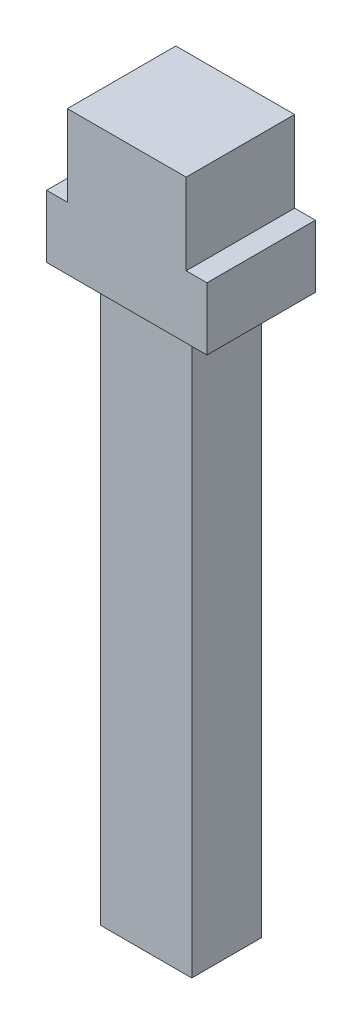
ISO-10303-21;
HEADER;
FILE_DESCRIPTION(('STEP AP214'),'2;1');
FILE_NAME('part.step','',(''),(''),'','','');
FILE_SCHEMA(('AUTOMOTIVE_DESIGN { 1 0 10303 214 1 1 1 1 }'));
ENDSEC;
DATA;
#1=APPLICATION_CONTEXT('core data for automotive mechanical design processes');
#2=APPLICATION_PROTOCOL_DEFINITION('international standard','automotive_design',2000,#1);
#3=PRODUCT_CONTEXT('',#1,'mechanical');
#4=PRODUCT('Part','Part','',(#3));
#5=PRODUCT_RELATED_PRODUCT_CATEGORY('part','',(#4));
#6=PRODUCT_DEFINITION_FORMATION('','',#4);
#7=PRODUCT_DEFINITION_CONTEXT('part definition',#1,'design');
#8=PRODUCT_DEFINITION('design','',#6,#7);
#9=PRODUCT_DEFINITION_SHAPE('','',#8);
#10=(LENGTH_UNIT() NAMED_UNIT(*) SI_UNIT(.MILLI.,.METRE.));
#11=(NAMED_UNIT(*) PLANE_ANGLE_UNIT() SI_UNIT($,.RADIAN.));
#12=(NAMED_UNIT(*) SI_UNIT($,.STERADIAN.) SOLID_ANGLE_UNIT());
#13=UNCERTAINTY_MEASURE_WITH_UNIT(LENGTH_MEASURE(1.E-05),#10,'distance_accuracy_value','');
#14=(GEOMETRIC_REPRESENTATION_CONTEXT(3) GLOBAL_UNCERTAINTY_ASSIGNED_CONTEXT((#13)) GLOBAL_UNIT_ASSIGNED_CONTEXT((#10,
#11,#12)) REPRESENTATION_CONTEXT('',''));
#15=CARTESIAN_POINT('',(0.,0.,0.));
#16=DIRECTION('',(0.,0.,1.));
#17=DIRECTION('',(1.,0.,0.));
#18=AXIS2_PLACEMENT_3D('',#15,#16,#17);
#19=CARTESIAN_POINT('',(-8.84957474512028,-124.622991811933,161.934903655726));
#20=DIRECTION('',(1.,0.,0.));
#21=DIRECTION('',(0.,0.,-1.));
#22=AXIS2_PLACEMENT_3D('',#19,#20,#21);
#23=PLANE('',#22);
#24=DIRECTION('',(0.,0.,-1.));
#25=VECTOR('',#24,1.);
#26=CARTESIAN_POINT('',(-8.84957474512028,-14.9673781187453,161.934903655726));
#27=LINE('',#26,#25);
#28=CARTESIAN_POINT('',(-8.84957474512028,-14.9673781187453,17.2656590375576));
#29=VERTEX_POINT('',#28);
#30=CARTESIAN_POINT('',(-8.84957474512028,-14.9673781187453,3.73434096244463));
#31=VERTEX_POINT('',#30);
#32=EDGE_CURVE('E140',#29,#31,#27,.T.);
#33=ORIENTED_EDGE('',*,*,#32,.T.);
#34=DIRECTION('',(0.,1.,0.));
#35=VECTOR('',#34,1.);
#36=CARTESIAN_POINT('',(-8.84957474512028,-14.9673781187453,3.73434096244463));
#37=LINE('',#36,#35);
#38=CARTESIAN_POINT('',(-8.84957474512028,-124.622991811933,3.73434096244463));
#39=VERTEX_POINT('',#38);
#40=EDGE_CURVE('E399',#39,#31,#37,.T.);
#41=ORIENTED_EDGE('',*,*,#40,.F.);
#42=DIRECTION('',(0.,0.,-1.));
#43=VECTOR('',#42,1.);
#44=CARTESIAN_POINT('',(-8.84957474512028,-124.622991811933,161.934903655726));
#45=LINE('',#44,#43);
#46=CARTESIAN_POINT('',(-8.84957474512028,-124.622991811933,17.2656590375576));
#47=VERTEX_POINT('',#46);
#48=EDGE_CURVE('E143',#47,#39,#45,.T.);
#49=ORIENTED_EDGE('',*,*,#48,.F.);
#50=DIRECTION('',(0.,-1.,0.));
#51=VECTOR('',#50,1.);
#52=CARTESIAN_POINT('',(-8.84957474512028,-14.9673781187453,17.2656590375576));
#53=LINE('',#52,#51);
#54=EDGE_CURVE('E412',#29,#47,#53,.T.);
#55=ORIENTED_EDGE('',*,*,#54,.F.);
#56=EDGE_LOOP('',(#33,#41,#49,#55));
#57=FACE_BOUND('',#56,.T.);
#58=ADVANCED_FACE('F36',(#57),#23,.F.);
#59=CARTESIAN_POINT('',(-8.84957474512028,-124.622991811933,161.934903655726));
#60=DIRECTION('',(0.,1.,0.));
#61=DIRECTION('',(0.,0.,1.));
#62=AXIS2_PLACEMENT_3D('',#59,#60,#61);
#63=PLANE('',#62);
#64=ORIENTED_EDGE('',*,*,#48,.T.);
#65=DIRECTION('',(-1.,0.,0.));
#66=VECTOR('',#65,1.);
#67=CARTESIAN_POINT('',(15.5210878769699,-124.622991811933,3.73434096244463));
#68=LINE('',#67,#66);
#69=CARTESIAN_POINT('',(8.84957474512029,-124.622991811933,3.73434096244463));
#70=VERTEX_POINT('',#69);
#71=EDGE_CURVE('E391',#70,#39,#68,.T.);
#72=ORIENTED_EDGE('',*,*,#71,.F.);
#73=DIRECTION('',(0.,0.,-1.));
#74=VECTOR('',#73,1.);
#75=CARTESIAN_POINT('',(8.84957474512029,-124.622991811933,161.934903655726));
#76=LINE('',#75,#74);
#77=CARTESIAN_POINT('',(8.84957474512029,-124.622991811933,17.2656590375576));
#78=VERTEX_POINT('',#77);
#79=EDGE_CURVE('E147',#78,#70,#76,.T.);
#80=ORIENTED_EDGE('',*,*,#79,.F.);
#81=DIRECTION('',(-1.,0.,0.));
#82=VECTOR('',#81,1.);
#83=CARTESIAN_POINT('',(15.5210878769699,-124.622991811933,17.2656590375576));
#84=LINE('',#83,#82);
#85=EDGE_CURVE('E419',#78,#47,#84,.T.);
#86=ORIENTED_EDGE('',*,*,#85,.T.);
#87=EDGE_LOOP('',(#64,#72,#80,#86));
#88=FACE_BOUND('',#87,.T.);
#89=ADVANCED_FACE('F209',(#88),#63,.F.);
#90=CARTESIAN_POINT('',(8.84957474512029,-124.622991811933,161.934903655726));
#91=DIRECTION('',(-1.,0.,0.));
#92=DIRECTION('',(0.,-1.,0.));
#93=AXIS2_PLACEMENT_3D('',#90,#91,#92);
#94=PLANE('',#93);
#95=ORIENTED_EDGE('',*,*,#79,.T.);
#96=DIRECTION('',(0.,-1.,0.));
#97=VECTOR('',#96,1.);
#98=CARTESIAN_POINT('',(8.84957474512029,-14.9673781187453,3.73434096244463));
#99=LINE('',#98,#97);
#100=CARTESIAN_POINT('',(8.84957474512029,-14.9673781187453,3.73434096244463));
#101=VERTEX_POINT('',#100);
#102=EDGE_CURVE('E387',#101,#70,#99,.T.);
#103=ORIENTED_EDGE('',*,*,#102,.F.);
#104=DIRECTION('',(0.,0.,-1.));
#105=VECTOR('',#104,1.);
#106=CARTESIAN_POINT('',(8.84957474512029,-14.9673781187453,161.934903655726));
#107=LINE('',#106,#105);
#108=CARTESIAN_POINT('',(8.84957474512029,-14.9673781187453,17.2656590375576));
#109=VERTEX_POINT('',#108);
#110=EDGE_CURVE('E150',#109,#101,#107,.T.);
#111=ORIENTED_EDGE('',*,*,#110,.F.);
#112=DIRECTION('',(0.,1.,0.));
#113=VECTOR('',#112,1.);
#114=CARTESIAN_POINT('',(8.84957474512029,-14.9673781187453,17.2656590375576));
#115=LINE('',#114,#113);
#116=EDGE_CURVE('E407',#78,#109,#115,.T.);
#117=ORIENTED_EDGE('',*,*,#116,.F.);
#118=EDGE_LOOP('',(#95,#103,#111,#117));
#119=FACE_BOUND('',#118,.T.);
#120=ADVANCED_FACE('F214',(#119),#94,.F.);
#121=CARTESIAN_POINT('',(11.5200878769699,-14.9673781187453,161.934903655726));
#122=DIRECTION('',(0.,1.,0.));
#123=DIRECTION('',(0.,0.,1.));
#124=AXIS2_PLACEMENT_3D('',#121,#122,#123);
#125=PLANE('',#124);
#126=DIRECTION('',(0.,0.,-1.));
#127=VECTOR('',#126,1.);
#128=CARTESIAN_POINT('',(-15.5200878769699,-14.9673781187453,161.934903655726));
#129=LINE('',#128,#127);
#130=CARTESIAN_POINT('',(-15.5200878769699,-14.9673781187453,21.0000000000019));
#131=VERTEX_POINT('',#130);
#132=CARTESIAN_POINT('',(-15.5200878769699,-14.9673781187453,0.));
#133=VERTEX_POINT('',#132);
#134=EDGE_CURVE('E40',#131,#133,#129,.T.);
#135=ORIENTED_EDGE('',*,*,#134,.T.);
#136=DIRECTION('',(1.,0.,0.));
#137=VECTOR('',#136,1.);
#138=CARTESIAN_POINT('',(11.5200878769699,-14.9673781187453,0.));
#139=LINE('',#138,#137);
#140=CARTESIAN_POINT('',(15.5200878769699,-14.9673781187453,0.));
#141=VERTEX_POINT('',#140);
#142=EDGE_CURVE('E55',#133,#141,#139,.T.);
#143=ORIENTED_EDGE('',*,*,#142,.T.);
#144=DIRECTION('',(0.,0.,-1.));
#145=VECTOR('',#144,1.);
#146=CARTESIAN_POINT('',(15.5200878769699,-14.9673781187453,161.934903655726));
#147=LINE('',#146,#145);
#148=CARTESIAN_POINT('',(15.5200878769699,-14.9673781187453,21.0000000000019));
#149=VERTEX_POINT('',#148);
#150=EDGE_CURVE('E153',#149,#141,#147,.T.);
#151=ORIENTED_EDGE('',*,*,#150,.F.);
#152=DIRECTION('',(1.,0.,0.));
#153=VECTOR('',#152,1.);
#154=CARTESIAN_POINT('',(-15.5200878769699,-14.9673781187453,21.0000000000019));
#155=LINE('',#154,#153);
#156=EDGE_CURVE('E138',#131,#149,#155,.T.);
#157=ORIENTED_EDGE('',*,*,#156,.F.);
#158=EDGE_LOOP('',(#135,#143,#151,#157));
#159=FACE_BOUND('',#158,.T.);
#160=CARTESIAN_POINT('',(12.1848313110451,-14.9673781187453,10.5000000000011));
#161=DIRECTION('',(0.,-1.,0.));
#162=DIRECTION('',(0.,0.,1.));
#163=AXIS2_PLACEMENT_3D('',#160,#161,#162);
#164=CIRCLE('',#163,2.33271488157284);
#165=CARTESIAN_POINT('',(12.1848313110451,-14.9673781187453,12.832714881574));
#166=VERTEX_POINT('',#165);
#167=EDGE_CURVE('E421',#166,#166,#164,.T.);
#168=ORIENTED_EDGE('',*,*,#167,.F.);
#169=EDGE_LOOP('',(#168));
#170=FACE_BOUND('',#169,.T.);
#171=DIRECTION('',(-1.,0.,0.));
#172=VECTOR('',#171,1.);
#173=CARTESIAN_POINT('',(15.5210878769699,-14.9673781187453,3.73434096244463));
#174=LINE('',#173,#172);
#175=EDGE_CURVE('E395',#101,#31,#174,.T.);
#176=ORIENTED_EDGE('',*,*,#175,.T.);
#177=ORIENTED_EDGE('',*,*,#32,.F.);
#178=DIRECTION('',(-1.,0.,0.));
#179=VECTOR('',#178,1.);
#180=CARTESIAN_POINT('',(15.5210878769699,-14.9673781187453,17.2656590375576));
#181=LINE('',#180,#179);
#182=EDGE_CURVE('E415',#109,#29,#181,.T.);
#183=ORIENTED_EDGE('',*,*,#182,.F.);
#184=ORIENTED_EDGE('',*,*,#110,.T.);
#185=EDGE_LOOP('',(#176,#177,#183,#184));
#186=FACE_BOUND('',#185,.T.);
#187=CARTESIAN_POINT('',(-12.1848313110451,-14.9673781187453,10.5000000000011));
#188=DIRECTION('',(0.,-1.,0.));
#189=DIRECTION('',(0.,0.,-1.));
#190=AXIS2_PLACEMENT_3D('',#187,#188,#189);
#191=CIRCLE('',#190,2.33271488157284);
#192=CARTESIAN_POINT('',(-12.1848313110451,-14.9673781187453,8.16728511842828));
#193=VERTEX_POINT('',#192);
#194=EDGE_CURVE('E426',#193,#193,#191,.T.);
#195=ORIENTED_EDGE('',*,*,#194,.F.);
#196=EDGE_LOOP('',(#195));
#197=FACE_BOUND('',#196,.T.);
#198=ADVANCED_FACE('F182',(#159,#170,#186,#197),#125,.F.);
#199=CARTESIAN_POINT('',(15.5200878769699,-14.9673781187453,161.934903655726));
#200=DIRECTION('',(-1.,0.,0.));
#201=DIRECTION('',(0.,0.,1.));
#202=AXIS2_PLACEMENT_3D('',#199,#200,#201);
#203=PLANE('',#202);
#204=DIRECTION('',(0.,1.,0.));
#205=VECTOR('',#204,1.);
#206=CARTESIAN_POINT('',(15.5200878769699,-14.9673781187452,21.0000000000019));
#207=LINE('',#206,#205);
#208=CARTESIAN_POINT('',(15.5200878769699,-2.86166346970542,21.0000000000019));
#209=VERTEX_POINT('',#208);
#210=EDGE_CURVE('E135',#149,#209,#207,.T.);
#211=ORIENTED_EDGE('',*,*,#210,.F.);
#212=ORIENTED_EDGE('',*,*,#150,.T.);
#213=DIRECTION('',(0.,1.,0.));
#214=VECTOR('',#213,1.);
#215=CARTESIAN_POINT('',(15.5200878769699,-14.9673781187453,0.));
#216=LINE('',#215,#214);
#217=CARTESIAN_POINT('',(15.5200878769699,-2.86166346970542,0.));
#218=VERTEX_POINT('',#217);
#219=EDGE_CURVE('E155',#141,#218,#216,.T.);
#220=ORIENTED_EDGE('',*,*,#219,.T.);
#221=DIRECTION('',(0.,0.,-1.));
#222=VECTOR('',#221,1.);
#223=CARTESIAN_POINT('',(15.5200878769699,-2.86166346970542,161.934903655726));
#224=LINE('',#223,#222);
#225=EDGE_CURVE('E88',#209,#218,#224,.T.);
#226=ORIENTED_EDGE('',*,*,#225,.F.);
#227=EDGE_LOOP('',(#211,#212,#220,#226));
#228=FACE_BOUND('',#227,.T.);
#229=ADVANCED_FACE('F190',(#228),#203,.F.);
#230=CARTESIAN_POINT('',(11.4999958000612,-2.86166346970542,161.934903655726));
#231=DIRECTION('',(0.,-1.,0.));
#232=DIRECTION('',(0.,0.,-1.));
#233=AXIS2_PLACEMENT_3D('',#230,#231,#232);
#234=PLANE('',#233);
#235=DIRECTION('',(-1.,0.,0.));
#236=VECTOR('',#235,1.);
#237=CARTESIAN_POINT('',(11.4999958000612,-2.86166346970542,21.0000000000019));
#238=LINE('',#237,#236);
#239=CARTESIAN_POINT('',(11.4999958000612,-2.86166346970542,21.0000000000019));
#240=VERTEX_POINT('',#239);
#241=EDGE_CURVE('E95',#209,#240,#238,.T.);
#242=ORIENTED_EDGE('',*,*,#241,.F.);
#243=ORIENTED_EDGE('',*,*,#225,.T.);
#244=DIRECTION('',(-1.,0.,0.));
#245=VECTOR('',#244,1.);
#246=CARTESIAN_POINT('',(11.4999958000612,-2.86166346970542,0.));
#247=LINE('',#246,#245);
#248=CARTESIAN_POINT('',(11.4999958000612,-2.86166346970542,0.));
#249=VERTEX_POINT('',#248);
#250=EDGE_CURVE('E157',#218,#249,#247,.T.);
#251=ORIENTED_EDGE('',*,*,#250,.T.);
#252=DIRECTION('',(0.,0.,-1.));
#253=VECTOR('',#252,1.);
#254=CARTESIAN_POINT('',(11.4999958000612,-2.86166346970542,161.934903655726));
#255=LINE('',#254,#253);
#256=EDGE_CURVE('E158',#240,#249,#255,.T.);
#257=ORIENTED_EDGE('',*,*,#256,.F.);
#258=EDGE_LOOP('',(#242,#243,#251,#257));
#259=FACE_BOUND('',#258,.T.);
#260=ADVANCED_FACE('F199',(#259),#234,.F.);
#261=CARTESIAN_POINT('',(11.4999958000612,-2.86166346970542,161.934903655726));
#262=DIRECTION('',(-1.,0.,0.));
#263=DIRECTION('',(0.,0.,1.));
#264=AXIS2_PLACEMENT_3D('',#261,#262,#263);
#265=PLANE('',#264);
#266=DIRECTION('',(0.,1.,0.));
#267=VECTOR('',#266,1.);
#268=CARTESIAN_POINT('',(11.4999958000612,-2.86166346970528,21.0000000000019));
#269=LINE('',#268,#267);
#270=CARTESIAN_POINT('',(11.4999958000612,12.8512041581204,21.000000000002));
#271=VERTEX_POINT('',#270);
#272=EDGE_CURVE('E130',#240,#271,#269,.T.);
#273=ORIENTED_EDGE('',*,*,#272,.F.);
#274=ORIENTED_EDGE('',*,*,#256,.T.);
#275=DIRECTION('',(0.,1.,0.));
#276=VECTOR('',#275,1.);
#277=CARTESIAN_POINT('',(11.4999958000612,-2.86166346970542,0.));
#278=LINE('',#277,#276);
#279=CARTESIAN_POINT('',(11.4999958000612,12.8512041581204,0.));
#280=VERTEX_POINT('',#279);
#281=EDGE_CURVE('E160',#249,#280,#278,.T.);
#282=ORIENTED_EDGE('',*,*,#281,.T.);
#283=DIRECTION('',(0.,0.,-1.));
#284=VECTOR('',#283,1.);
#285=CARTESIAN_POINT('',(11.4999958000612,12.8512041581204,161.934903655726));
#286=LINE('',#285,#284);
#287=EDGE_CURVE('E161',#271,#280,#286,.T.);
#288=ORIENTED_EDGE('',*,*,#287,.F.);
#289=EDGE_LOOP('',(#273,#274,#282,#288));
#290=FACE_BOUND('',#289,.T.);
#291=ADVANCED_FACE('F198',(#290),#265,.F.);
#292=CARTESIAN_POINT('',(-11.4999958000612,12.8315472433894,161.934903655726));
#293=DIRECTION('',(0.000854648466561483,-0.999999634787933,0.));
#294=DIRECTION('',(0.999999634787933,0.000854648466561483,0.));
#295=AXIS2_PLACEMENT_3D('',#292,#293,#294);
#296=PLANE('',#295);
#297=DIRECTION('',(-0.999999634787933,-0.000854648466561483,0.));
#298=VECTOR('',#297,1.);
#299=CARTESIAN_POINT('',(-11.4999958000612,12.8315472433894,21.000000000002));
#300=LINE('',#299,#298);
#301=CARTESIAN_POINT('',(-11.4999958000612,12.8315472433894,21.0000000000019));
#302=VERTEX_POINT('',#301);
#303=EDGE_CURVE('E128',#271,#302,#300,.T.);
#304=ORIENTED_EDGE('',*,*,#303,.F.);
#305=ORIENTED_EDGE('',*,*,#287,.T.);
#306=DIRECTION('',(-0.999999634787933,-0.000854648466561483,0.));
#307=VECTOR('',#306,1.);
#308=CARTESIAN_POINT('',(-11.4999958000612,12.8315472433894,0.));
#309=LINE('',#308,#307);
#310=CARTESIAN_POINT('',(-11.4999958000612,12.8315472433894,0.));
#311=VERTEX_POINT('',#310);
#312=EDGE_CURVE('E163',#280,#311,#309,.T.);
#313=ORIENTED_EDGE('',*,*,#312,.T.);
#314=DIRECTION('',(0.,0.,-1.));
#315=VECTOR('',#314,1.);
#316=CARTESIAN_POINT('',(-11.4999958000612,12.8315472433894,161.934903655726));
#317=LINE('',#316,#315);
#318=EDGE_CURVE('E164',#302,#311,#317,.T.);
#319=ORIENTED_EDGE('',*,*,#318,.F.);
#320=EDGE_LOOP('',(#304,#305,#313,#319));
#321=FACE_BOUND('',#320,.T.);
#322=ADVANCED_FACE('F195',(#321),#296,.F.);
#323=CARTESIAN_POINT('',(-11.4999958000612,-2.86166346970542,161.934903655726));
#324=DIRECTION('',(1.,0.,0.));
#325=DIRECTION('',(0.,0.,-1.));
#326=AXIS2_PLACEMENT_3D('',#323,#324,#325);
#327=PLANE('',#326);
#328=DIRECTION('',(0.,-1.,0.));
#329=VECTOR('',#328,1.);
#330=CARTESIAN_POINT('',(-11.4999958000612,-2.86166346970528,21.0000000000019));
#331=LINE('',#330,#329);
#332=CARTESIAN_POINT('',(-11.4999958000612,-2.86166346970542,21.0000000000019));
#333=VERTEX_POINT('',#332);
#334=EDGE_CURVE('E115',#302,#333,#331,.T.);
#335=ORIENTED_EDGE('',*,*,#334,.F.);
#336=ORIENTED_EDGE('',*,*,#318,.T.);
#337=DIRECTION('',(0.,-1.,0.));
#338=VECTOR('',#337,1.);
#339=CARTESIAN_POINT('',(-11.4999958000612,-2.86166346970542,0.));
#340=LINE('',#339,#338);
#341=CARTESIAN_POINT('',(-11.4999958000612,-2.86166346970542,0.));
#342=VERTEX_POINT('',#341);
#343=EDGE_CURVE('E121',#311,#342,#340,.T.);
#344=ORIENTED_EDGE('',*,*,#343,.T.);
#345=DIRECTION('',(0.,0.,-1.));
#346=VECTOR('',#345,1.);
#347=CARTESIAN_POINT('',(-11.4999958000612,-2.86166346970542,161.934903655726));
#348=LINE('',#347,#346);
#349=EDGE_CURVE('E110',#333,#342,#348,.T.);
#350=ORIENTED_EDGE('',*,*,#349,.F.);
#351=EDGE_LOOP('',(#335,#336,#344,#350));
#352=FACE_BOUND('',#351,.T.);
#353=ADVANCED_FACE('F118',(#352),#327,.F.);
#354=CARTESIAN_POINT('',(-15.5200878769699,-2.86166346970542,161.934903655726));
#355=DIRECTION('',(0.,-1.,0.));
#356=DIRECTION('',(0.,0.,-1.));
#357=AXIS2_PLACEMENT_3D('',#354,#355,#356);
#358=PLANE('',#357);
#359=DIRECTION('',(-1.,0.,0.));
#360=VECTOR('',#359,1.);
#361=CARTESIAN_POINT('',(-15.5200878769699,-2.86166346970542,21.0000000000019));
#362=LINE('',#361,#360);
#363=CARTESIAN_POINT('',(-15.5200878769699,-2.86166346970542,21.0000000000019));
#364=VERTEX_POINT('',#363);
#365=EDGE_CURVE('E46',#333,#364,#362,.T.);
#366=ORIENTED_EDGE('',*,*,#365,.F.);
#367=ORIENTED_EDGE('',*,*,#349,.T.);
#368=DIRECTION('',(-1.,0.,0.));
#369=VECTOR('',#368,1.);
#370=CARTESIAN_POINT('',(-15.5200878769699,-2.86166346970542,0.));
#371=LINE('',#370,#369);
#372=CARTESIAN_POINT('',(-15.5200878769699,-2.86166346970542,0.));
#373=VERTEX_POINT('',#372);
#374=EDGE_CURVE('E123',#342,#373,#371,.T.);
#375=ORIENTED_EDGE('',*,*,#374,.T.);
#376=DIRECTION('',(0.,0.,-1.));
#377=VECTOR('',#376,1.);
#378=CARTESIAN_POINT('',(-15.5200878769699,-2.86166346970542,161.934903655726));
#379=LINE('',#378,#377);
#380=EDGE_CURVE('E112',#364,#373,#379,.T.);
#381=ORIENTED_EDGE('',*,*,#380,.F.);
#382=EDGE_LOOP('',(#366,#367,#375,#381));
#383=FACE_BOUND('',#382,.T.);
#384=ADVANCED_FACE('F108',(#383),#358,.F.);
#385=CARTESIAN_POINT('',(-15.5200878769699,-14.9673781187453,161.934903655726));
#386=DIRECTION('',(1.,0.,0.));
#387=DIRECTION('',(0.,0.,-1.));
#388=AXIS2_PLACEMENT_3D('',#385,#386,#387);
#389=PLANE('',#388);
#390=DIRECTION('',(0.,-1.,0.));
#391=VECTOR('',#390,1.);
#392=CARTESIAN_POINT('',(-15.5200878769699,-14.9673781187452,21.0000000000019));
#393=LINE('',#392,#391);
#394=EDGE_CURVE('E12',#364,#131,#393,.T.);
#395=ORIENTED_EDGE('',*,*,#394,.F.);
#396=ORIENTED_EDGE('',*,*,#380,.T.);
#397=DIRECTION('',(0.,-1.,0.));
#398=VECTOR('',#397,1.);
#399=CARTESIAN_POINT('',(-15.5200878769699,-14.9673781187453,0.));
#400=LINE('',#399,#398);
#401=EDGE_CURVE('E165',#373,#133,#400,.T.);
#402=ORIENTED_EDGE('',*,*,#401,.T.);
#403=ORIENTED_EDGE('',*,*,#134,.F.);
#404=EDGE_LOOP('',(#395,#396,#402,#403));
#405=FACE_BOUND('',#404,.T.);
#406=ADVANCED_FACE('F192',(#405),#389,.F.);
#407=CARTESIAN_POINT('',(0.,0.,0.));
#408=DIRECTION('',(0.,0.,1.));
#409=DIRECTION('',(1.,0.,0.));
#410=AXIS2_PLACEMENT_3D('',#407,#408,#409);
#411=PLANE('',#410);
#412=ORIENTED_EDGE('',*,*,#142,.F.);
#413=ORIENTED_EDGE('',*,*,#401,.F.);
#414=ORIENTED_EDGE('',*,*,#374,.F.);
#415=ORIENTED_EDGE('',*,*,#343,.F.);
#416=ORIENTED_EDGE('',*,*,#312,.F.);
#417=ORIENTED_EDGE('',*,*,#281,.F.);
#418=ORIENTED_EDGE('',*,*,#250,.F.);
#419=ORIENTED_EDGE('',*,*,#219,.F.);
#420=EDGE_LOOP('',(#412,#413,#414,#415,#416,#417,#418,#419));
#421=FACE_BOUND('',#420,.T.);
#422=ADVANCED_FACE('F186',(#421),#411,.F.);
#423=CARTESIAN_POINT('',(-15.500004199938,44.2762446865819,21.000000000002));
#424=DIRECTION('',(0.,0.,1.));
#425=DIRECTION('',(1.,0.,0.));
#426=AXIS2_PLACEMENT_3D('',#423,#424,#425);
#427=PLANE('',#426);
#428=ORIENTED_EDGE('',*,*,#156,.T.);
#429=ORIENTED_EDGE('',*,*,#210,.T.);
#430=ORIENTED_EDGE('',*,*,#241,.T.);
#431=ORIENTED_EDGE('',*,*,#272,.T.);
#432=ORIENTED_EDGE('',*,*,#303,.T.);
#433=ORIENTED_EDGE('',*,*,#334,.T.);
#434=ORIENTED_EDGE('',*,*,#365,.T.);
#435=ORIENTED_EDGE('',*,*,#394,.T.);
#436=EDGE_LOOP('',(#428,#429,#430,#431,#432,#433,#434,#435));
#437=FACE_BOUND('',#436,.T.);
#438=ADVANCED_FACE('F38',(#437),#427,.T.);
#439=CARTESIAN_POINT('',(-12.1848313110451,-3.9673781187453,10.5000000000011));
#440=DIRECTION('',(0.,-1.,0.));
#441=DIRECTION('',(0.,0.,-1.));
#442=AXIS2_PLACEMENT_3D('',#439,#440,#441);
#443=CYLINDRICAL_SURFACE('',#442,2.33271488157284);
#444=CARTESIAN_POINT('',(-12.1848313110451,-3.9673781187453,10.5000000000011));
#445=DIRECTION('',(0.,-1.,0.));
#446=DIRECTION('',(0.,0.,-1.));
#447=AXIS2_PLACEMENT_3D('',#444,#445,#446);
#448=CIRCLE('',#447,2.33271488157284);
#449=CARTESIAN_POINT('',(-12.1848313110451,-3.9673781187453,8.16728511842828));
#450=VERTEX_POINT('',#449);
#451=EDGE_CURVE('E144',#450,#450,#448,.T.);
#452=ORIENTED_EDGE('',*,*,#451,.F.);
#453=EDGE_LOOP('',(#452));
#454=FACE_BOUND('',#453,.T.);
#455=ORIENTED_EDGE('',*,*,#194,.T.);
#456=EDGE_LOOP('',(#455));
#457=FACE_BOUND('',#456,.T.);
#458=ADVANCED_FACE('F281',(#454,#457),#443,.F.);
#459=CARTESIAN_POINT('',(-12.1848313110451,-3.9673781187453,10.5000000000011));
#460=DIRECTION('',(0.,-1.,0.));
#461=DIRECTION('',(0.,0.,-1.));
#462=AXIS2_PLACEMENT_3D('',#459,#460,#461);
#463=PLANE('',#462);
#464=ORIENTED_EDGE('',*,*,#451,.T.);
#465=EDGE_LOOP('',(#464));
#466=FACE_BOUND('',#465,.T.);
#467=ADVANCED_FACE('F286',(#466),#463,.T.);
#468=CARTESIAN_POINT('',(12.1848313110451,-3.9673781187453,10.5000000000011));
#469=DIRECTION('',(0.,-1.,0.));
#470=DIRECTION('',(0.,0.,-1.));
#471=AXIS2_PLACEMENT_3D('',#468,#469,#470);
#472=CYLINDRICAL_SURFACE('',#471,2.33271488157284);
#473=CARTESIAN_POINT('',(12.1848313110451,-3.9673781187453,10.5000000000011));
#474=DIRECTION('',(0.,-1.,0.));
#475=DIRECTION('',(0.,0.,1.));
#476=AXIS2_PLACEMENT_3D('',#473,#474,#475);
#477=CIRCLE('',#476,2.33271488157284);
#478=CARTESIAN_POINT('',(12.1848313110451,-3.9673781187453,12.832714881574));
#479=VERTEX_POINT('',#478);
#480=EDGE_CURVE('E423',#479,#479,#477,.T.);
#481=ORIENTED_EDGE('',*,*,#480,.F.);
#482=EDGE_LOOP('',(#481));
#483=FACE_BOUND('',#482,.T.);
#484=ORIENTED_EDGE('',*,*,#167,.T.);
#485=EDGE_LOOP('',(#484));
#486=FACE_BOUND('',#485,.T.);
#487=ADVANCED_FACE('F298',(#483,#486),#472,.F.);
#488=CARTESIAN_POINT('',(12.1848313110451,-3.9673781187453,10.5000000000011));
#489=DIRECTION('',(0.,1.,0.));
#490=DIRECTION('',(0.,0.,1.));
#491=AXIS2_PLACEMENT_3D('',#488,#489,#490);
#492=PLANE('',#491);
#493=ORIENTED_EDGE('',*,*,#480,.T.);
#494=EDGE_LOOP('',(#493));
#495=FACE_BOUND('',#494,.T.);
#496=ADVANCED_FACE('F308',(#495),#492,.F.);
#497=CARTESIAN_POINT('',(15.5210878769699,-14.9673781187453,17.2656590375576));
#498=DIRECTION('',(0.,0.,-1.));
#499=DIRECTION('',(0.,1.,0.));
#500=AXIS2_PLACEMENT_3D('',#497,#498,#499);
#501=PLANE('',#500);
#502=ORIENTED_EDGE('',*,*,#116,.T.);
#503=ORIENTED_EDGE('',*,*,#182,.T.);
#504=ORIENTED_EDGE('',*,*,#54,.T.);
#505=ORIENTED_EDGE('',*,*,#85,.F.);
#506=EDGE_LOOP('',(#502,#503,#504,#505));
#507=FACE_BOUND('',#506,.T.);
#508=ADVANCED_FACE('F317',(#507),#501,.F.);
#509=CARTESIAN_POINT('',(15.5210878769699,-14.9673781187453,3.73434096244463));
#510=DIRECTION('',(0.,0.,1.));
#511=DIRECTION('',(1.,0.,0.));
#512=AXIS2_PLACEMENT_3D('',#509,#510,#511);
#513=PLANE('',#512);
#514=ORIENTED_EDGE('',*,*,#102,.T.);
#515=ORIENTED_EDGE('',*,*,#71,.T.);
#516=ORIENTED_EDGE('',*,*,#40,.T.);
#517=ORIENTED_EDGE('',*,*,#175,.F.);
#518=EDGE_LOOP('',(#514,#515,#516,#517));
#519=FACE_BOUND('',#518,.T.);
#520=ADVANCED_FACE('F359',(#519),#513,.F.);
#521=CLOSED_SHELL('',(#58,#89,#120,#198,#229,#260,#291,#322,#353,#384,#406,#422,#438,#458,#467,
#487,#496,#508,#520));
#522=MANIFOLD_SOLID_BREP('B2',#521);
#523=ADVANCED_BREP_SHAPE_REPRESENTATION('',(#18,#522),#14);
#524=SHAPE_DEFINITION_REPRESENTATION(#9,#523);
ENDSEC;
END-ISO-10303-21;
